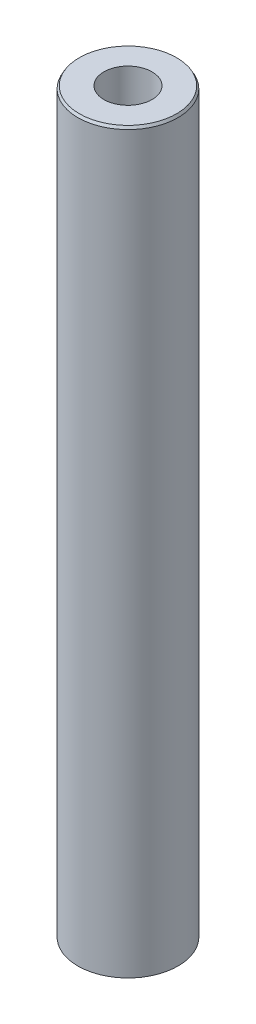
ISO-10303-21;
HEADER;
FILE_DESCRIPTION(('STEP AP214'),'2;1');
FILE_NAME('part.step','',(''),(''),'','','');
FILE_SCHEMA(('AUTOMOTIVE_DESIGN { 1 0 10303 214 1 1 1 1 }'));
ENDSEC;
DATA;
#1=APPLICATION_CONTEXT('core data for automotive mechanical design processes');
#2=APPLICATION_PROTOCOL_DEFINITION('international standard','automotive_design',2000,#1);
#3=PRODUCT_CONTEXT('',#1,'mechanical');
#4=PRODUCT('Part','Part','',(#3));
#5=PRODUCT_RELATED_PRODUCT_CATEGORY('part','',(#4));
#6=PRODUCT_DEFINITION_FORMATION('','',#4);
#7=PRODUCT_DEFINITION_CONTEXT('part definition',#1,'design');
#8=PRODUCT_DEFINITION('design','',#6,#7);
#9=PRODUCT_DEFINITION_SHAPE('','',#8);
#10=(LENGTH_UNIT() NAMED_UNIT(*) SI_UNIT(.MILLI.,.METRE.));
#11=(NAMED_UNIT(*) PLANE_ANGLE_UNIT() SI_UNIT($,.RADIAN.));
#12=(NAMED_UNIT(*) SI_UNIT($,.STERADIAN.) SOLID_ANGLE_UNIT());
#13=UNCERTAINTY_MEASURE_WITH_UNIT(LENGTH_MEASURE(1.E-05),#10,'distance_accuracy_value','');
#14=(GEOMETRIC_REPRESENTATION_CONTEXT(3) GLOBAL_UNCERTAINTY_ASSIGNED_CONTEXT((#13)) GLOBAL_UNIT_ASSIGNED_CONTEXT((#10,
#11,#12)) REPRESENTATION_CONTEXT('',''));
#15=CARTESIAN_POINT('',(0.,0.,0.));
#16=DIRECTION('',(0.,0.,1.));
#17=DIRECTION('',(1.,0.,0.));
#18=AXIS2_PLACEMENT_3D('',#15,#16,#17);
#19=CARTESIAN_POINT('',(0.,442.221871574424,0.));
#20=DIRECTION('',(0.,-1.,0.));
#21=DIRECTION('',(0.,0.,-1.));
#22=AXIS2_PLACEMENT_3D('',#19,#20,#21);
#23=CYLINDRICAL_SURFACE('',#22,30.);
#24=CARTESIAN_POINT('',(0.,440.661581051698,0.));
#25=DIRECTION('',(0.,1.,0.));
#26=DIRECTION('',(0.,0.,1.));
#27=AXIS2_PLACEMENT_3D('',#24,#25,#26);
#28=CIRCLE('',#27,30.);
#29=CARTESIAN_POINT('',(0.,440.661581051698,30.));
#30=VERTEX_POINT('',#29);
#31=EDGE_CURVE('E50',#30,#30,#28,.F.);
#32=ORIENTED_EDGE('',*,*,#31,.T.);
#33=EDGE_LOOP('',(#32));
#34=FACE_BOUND('',#33,.T.);
#35=CARTESIAN_POINT('',(0.,0.900834153310104,0.));
#36=DIRECTION('',(0.,1.,0.));
#37=DIRECTION('',(0.,0.,1.));
#38=AXIS2_PLACEMENT_3D('',#35,#36,#37);
#39=CIRCLE('',#38,30.);
#40=CARTESIAN_POINT('',(0.,0.900834153310104,30.));
#41=VERTEX_POINT('',#40);
#42=EDGE_CURVE('E51',#41,#41,#39,.T.);
#43=ORIENTED_EDGE('',*,*,#42,.T.);
#44=EDGE_LOOP('',(#43));
#45=FACE_BOUND('',#44,.T.);
#46=ADVANCED_FACE('F39',(#34,#45),#23,.T.);
#47=CARTESIAN_POINT('',(0.,442.221871574424,0.));
#48=DIRECTION('',(0.,1.,0.));
#49=DIRECTION('',(0.,0.,1.));
#50=AXIS2_PLACEMENT_3D('',#47,#48,#49);
#51=PLANE('',#50);
#52=CARTESIAN_POINT('',(0.,442.221871574424,0.));
#53=DIRECTION('',(0.,1.,0.));
#54=DIRECTION('',(0.,0.,1.));
#55=AXIS2_PLACEMENT_3D('',#52,#53,#54);
#56=CIRCLE('',#55,29.0991658466899);
#57=CARTESIAN_POINT('',(0.,442.221871574424,29.0991658466899));
#58=VERTEX_POINT('',#57);
#59=EDGE_CURVE('E54',#58,#58,#56,.T.);
#60=ORIENTED_EDGE('',*,*,#59,.T.);
#61=EDGE_LOOP('',(#60));
#62=FACE_BOUND('',#61,.T.);
#63=CARTESIAN_POINT('',(0.,442.221871574424,0.));
#64=DIRECTION('',(0.,1.,0.));
#65=DIRECTION('',(0.,0.,1.));
#66=AXIS2_PLACEMENT_3D('',#63,#64,#65);
#67=CIRCLE('',#66,14.3999244313986);
#68=CARTESIAN_POINT('',(0.,442.221871574424,14.3999244313986));
#69=VERTEX_POINT('',#68);
#70=EDGE_CURVE('E58',#69,#69,#67,.T.);
#71=ORIENTED_EDGE('',*,*,#70,.F.);
#72=EDGE_LOOP('',(#71));
#73=FACE_BOUND('',#72,.T.);
#74=ADVANCED_FACE('F69',(#62,#73),#51,.T.);
#75=CARTESIAN_POINT('',(0.,0.,0.));
#76=DIRECTION('',(0.,1.,0.));
#77=DIRECTION('',(0.,0.,1.));
#78=AXIS2_PLACEMENT_3D('',#75,#76,#77);
#79=PLANE('',#78);
#80=CARTESIAN_POINT('',(0.,0.,0.));
#81=DIRECTION('',(0.,1.,0.));
#82=DIRECTION('',(0.,0.,1.));
#83=AXIS2_PLACEMENT_3D('',#80,#81,#82);
#84=CIRCLE('',#83,28.4397094772736);
#85=CARTESIAN_POINT('',(0.,0.,28.4397094772736));
#86=VERTEX_POINT('',#85);
#87=EDGE_CURVE('E10',#86,#86,#84,.F.);
#88=ORIENTED_EDGE('',*,*,#87,.T.);
#89=EDGE_LOOP('',(#88));
#90=FACE_BOUND('',#89,.T.);
#91=CARTESIAN_POINT('',(0.,0.,0.));
#92=DIRECTION('',(0.,1.,0.));
#93=DIRECTION('',(0.,0.,1.));
#94=AXIS2_PLACEMENT_3D('',#91,#92,#93);
#95=CIRCLE('',#94,14.3999244313986);
#96=CARTESIAN_POINT('',(0.,0.,14.3999244313986));
#97=VERTEX_POINT('',#96);
#98=EDGE_CURVE('E63',#97,#97,#95,.T.);
#99=ORIENTED_EDGE('',*,*,#98,.T.);
#100=EDGE_LOOP('',(#99));
#101=FACE_BOUND('',#100,.T.);
#102=ADVANCED_FACE('F75',(#90,#101),#79,.F.);
#103=CARTESIAN_POINT('',(0.,442.221871574424,0.));
#104=DIRECTION('',(0.,-1.,0.));
#105=DIRECTION('',(0.,0.,-1.));
#106=AXIS2_PLACEMENT_3D('',#103,#104,#105);
#107=CYLINDRICAL_SURFACE('',#106,14.3999244313986);
#108=ORIENTED_EDGE('',*,*,#70,.T.);
#109=EDGE_LOOP('',(#108));
#110=FACE_BOUND('',#109,.T.);
#111=ORIENTED_EDGE('',*,*,#98,.F.);
#112=EDGE_LOOP('',(#111));
#113=FACE_BOUND('',#112,.T.);
#114=ADVANCED_FACE('F70',(#110,#113),#107,.F.);
#115=CARTESIAN_POINT('',(0.,442.221871574424,0.));
#116=DIRECTION('',(0.,-1.,0.));
#117=DIRECTION('',(0.,0.,-1.));
#118=AXIS2_PLACEMENT_3D('',#115,#116,#117);
#119=CONICAL_SURFACE('',#118,29.0991658466899,0.523598775598315);
#120=ORIENTED_EDGE('',*,*,#31,.F.);
#121=EDGE_LOOP('',(#120));
#122=FACE_BOUND('',#121,.T.);
#123=ORIENTED_EDGE('',*,*,#59,.F.);
#124=EDGE_LOOP('',(#123));
#125=FACE_BOUND('',#124,.T.);
#126=ADVANCED_FACE('F81',(#122,#125),#119,.T.);
#127=CARTESIAN_POINT('',(0.,0.900834153310104,0.));
#128=DIRECTION('',(0.,1.,0.));
#129=DIRECTION('',(0.,0.,1.));
#130=AXIS2_PLACEMENT_3D('',#127,#128,#129);
#131=CONICAL_SURFACE('',#130,30.,1.04719755119659);
#132=ORIENTED_EDGE('',*,*,#87,.F.);
#133=EDGE_LOOP('',(#132));
#134=FACE_BOUND('',#133,.T.);
#135=ORIENTED_EDGE('',*,*,#42,.F.);
#136=EDGE_LOOP('',(#135));
#137=FACE_BOUND('',#136,.T.);
#138=ADVANCED_FACE('F45',(#134,#137),#131,.T.);
#139=CLOSED_SHELL('',(#46,#74,#102,#114,#126,#138));
#140=MANIFOLD_SOLID_BREP('B2',#139);
#141=ADVANCED_BREP_SHAPE_REPRESENTATION('',(#18,#140),#14);
#142=SHAPE_DEFINITION_REPRESENTATION(#9,#141);
ENDSEC;
END-ISO-10303-21;
